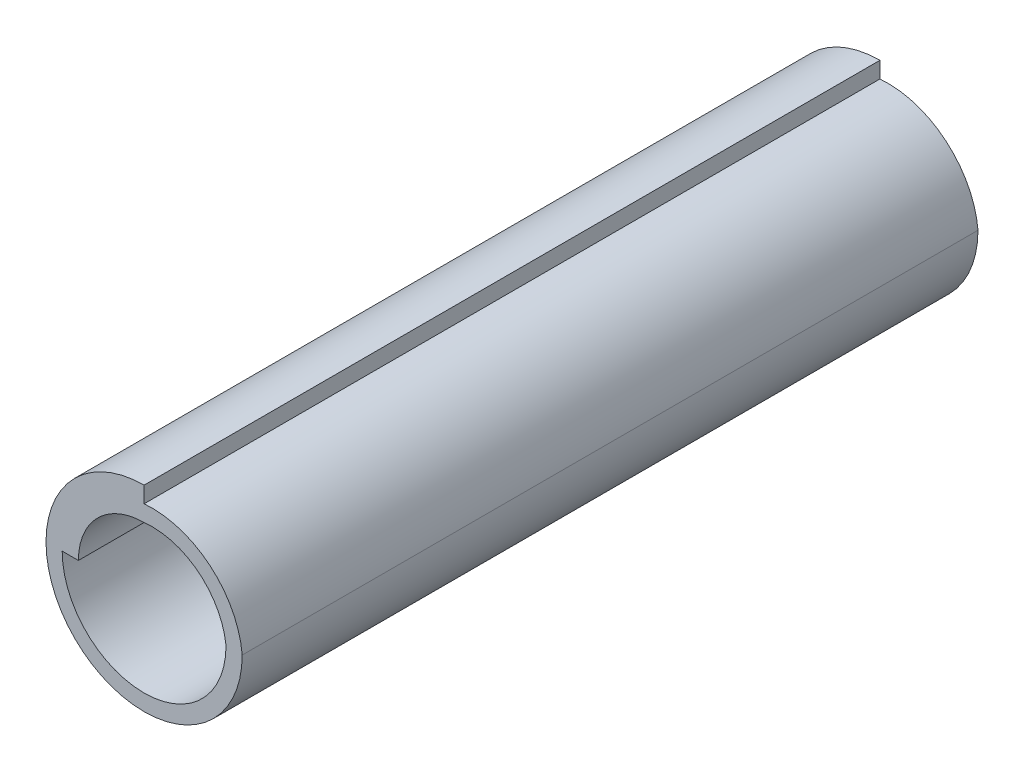
ISO-10303-21;
HEADER;
FILE_DESCRIPTION(('STEP AP214'),'2;1');
FILE_NAME('part.step','',(''),(''),'','','');
FILE_SCHEMA(('AUTOMOTIVE_DESIGN { 1 0 10303 214 1 1 1 1 }'));
ENDSEC;
DATA;
#1=APPLICATION_CONTEXT('core data for automotive mechanical design processes');
#2=APPLICATION_PROTOCOL_DEFINITION('international standard','automotive_design',2000,#1);
#3=PRODUCT_CONTEXT('',#1,'mechanical');
#4=PRODUCT('Part','Part','',(#3));
#5=PRODUCT_RELATED_PRODUCT_CATEGORY('part','',(#4));
#6=PRODUCT_DEFINITION_FORMATION('','',#4);
#7=PRODUCT_DEFINITION_CONTEXT('part definition',#1,'design');
#8=PRODUCT_DEFINITION('design','',#6,#7);
#9=PRODUCT_DEFINITION_SHAPE('','',#8);
#10=(LENGTH_UNIT() NAMED_UNIT(*) SI_UNIT(.MILLI.,.METRE.));
#11=(NAMED_UNIT(*) PLANE_ANGLE_UNIT() SI_UNIT($,.RADIAN.));
#12=(NAMED_UNIT(*) SI_UNIT($,.STERADIAN.) SOLID_ANGLE_UNIT());
#13=UNCERTAINTY_MEASURE_WITH_UNIT(LENGTH_MEASURE(1.E-05),#10,'distance_accuracy_value','');
#14=(GEOMETRIC_REPRESENTATION_CONTEXT(3) GLOBAL_UNCERTAINTY_ASSIGNED_CONTEXT((#13)) GLOBAL_UNIT_ASSIGNED_CONTEXT((#10,
#11,#12)) REPRESENTATION_CONTEXT('',''));
#15=CARTESIAN_POINT('',(0.,0.,0.));
#16=DIRECTION('',(0.,0.,1.));
#17=DIRECTION('',(1.,0.,0.));
#18=AXIS2_PLACEMENT_3D('',#15,#16,#17);
#19=CARTESIAN_POINT('',(0.165000000000001,-0.164999999999998,7.5));
#20=DIRECTION('',(0.,0.,1.));
#21=DIRECTION('',(1.,0.,0.));
#22=AXIS2_PLACEMENT_3D('',#19,#20,#21);
#23=PLANE('',#22);
#24=CARTESIAN_POINT('',(0.165000000000001,-0.164999999999998,7.5));
#25=DIRECTION('',(0.,0.,1.));
#26=DIRECTION('',(1.,0.,0.));
#27=AXIS2_PLACEMENT_3D('',#24,#25,#26);
#28=CIRCLE('',#27,1.84240332175124);
#29=CARTESIAN_POINT('',(2.,0.,7.5));
#30=VERTEX_POINT('',#29);
#31=CARTESIAN_POINT('',(0.,1.67,7.5));
#32=VERTEX_POINT('',#31);
#33=EDGE_CURVE('E134',#30,#32,#28,.T.);
#34=ORIENTED_EDGE('',*,*,#33,.T.);
#35=DIRECTION('',(0.,1.,0.));
#36=VECTOR('',#35,1.);
#37=CARTESIAN_POINT('',(0.,1.67,7.5));
#38=LINE('',#37,#36);
#39=CARTESIAN_POINT('',(0.,2.,7.5));
#40=VERTEX_POINT('',#39);
#41=EDGE_CURVE('E137',#32,#40,#38,.T.);
#42=ORIENTED_EDGE('',*,*,#41,.T.);
#43=CARTESIAN_POINT('',(0.,0.,7.5));
#44=DIRECTION('',(0.,0.,1.));
#45=DIRECTION('',(1.,0.,0.));
#46=AXIS2_PLACEMENT_3D('',#43,#44,#45);
#47=CIRCLE('',#46,2.);
#48=EDGE_CURVE('E140',#40,#30,#47,.T.);
#49=ORIENTED_EDGE('',*,*,#48,.T.);
#50=EDGE_LOOP('',(#34,#42,#49));
#51=FACE_BOUND('',#50,.T.);
#52=CARTESIAN_POINT('',(0.165000000000001,-0.164999999999998,7.5));
#53=DIRECTION('',(0.,0.,1.));
#54=DIRECTION('',(1.,0.,0.));
#55=AXIS2_PLACEMENT_3D('',#52,#53,#54);
#56=CIRCLE('',#55,1.51401783344847);
#57=CARTESIAN_POINT('',(1.67,0.,7.5));
#58=VERTEX_POINT('',#57);
#59=CARTESIAN_POINT('',(0.,1.34,7.5));
#60=VERTEX_POINT('',#59);
#61=EDGE_CURVE('E106',#58,#60,#56,.T.);
#62=ORIENTED_EDGE('',*,*,#61,.F.);
#63=CARTESIAN_POINT('',(0.,0.,7.5));
#64=DIRECTION('',(0.,0.,1.));
#65=DIRECTION('',(1.,0.,0.));
#66=AXIS2_PLACEMENT_3D('',#63,#64,#65);
#67=CIRCLE('',#66,1.67);
#68=CARTESIAN_POINT('',(-1.67,0.,7.5));
#69=VERTEX_POINT('',#68);
#70=EDGE_CURVE('E98',#69,#58,#67,.T.);
#71=ORIENTED_EDGE('',*,*,#70,.F.);
#72=DIRECTION('',(-1.,0.,0.));
#73=VECTOR('',#72,1.);
#74=CARTESIAN_POINT('',(-1.67,0.,7.5));
#75=LINE('',#74,#73);
#76=CARTESIAN_POINT('',(-1.34,0.,7.5));
#77=VERTEX_POINT('',#76);
#78=EDGE_CURVE('E120',#77,#69,#75,.T.);
#79=ORIENTED_EDGE('',*,*,#78,.F.);
#80=CARTESIAN_POINT('',(0.,0.,7.5));
#81=DIRECTION('',(0.,0.,1.));
#82=DIRECTION('',(1.,0.,0.));
#83=AXIS2_PLACEMENT_3D('',#80,#81,#82);
#84=CIRCLE('',#83,1.34);
#85=EDGE_CURVE('E118',#60,#77,#84,.T.);
#86=ORIENTED_EDGE('',*,*,#85,.F.);
#87=EDGE_LOOP('',(#62,#71,#79,#86));
#88=FACE_BOUND('',#87,.T.);
#89=ADVANCED_FACE('F39',(#51,#88),#23,.T.);
#90=CARTESIAN_POINT('',(0.165000000000001,-0.164999999999998,-7.5));
#91=DIRECTION('',(0.,0.,1.));
#92=DIRECTION('',(1.,0.,0.));
#93=AXIS2_PLACEMENT_3D('',#90,#91,#92);
#94=PLANE('',#93);
#95=CARTESIAN_POINT('',(0.165000000000001,-0.164999999999998,-7.5));
#96=DIRECTION('',(0.,0.,1.));
#97=DIRECTION('',(1.,0.,0.));
#98=AXIS2_PLACEMENT_3D('',#95,#96,#97);
#99=CIRCLE('',#98,1.84240332175124);
#100=CARTESIAN_POINT('',(2.,0.,-7.5));
#101=VERTEX_POINT('',#100);
#102=CARTESIAN_POINT('',(0.,1.67,-7.5));
#103=VERTEX_POINT('',#102);
#104=EDGE_CURVE('E114',#101,#103,#99,.T.);
#105=ORIENTED_EDGE('',*,*,#104,.F.);
#106=CARTESIAN_POINT('',(0.,0.,-7.5));
#107=DIRECTION('',(0.,0.,1.));
#108=DIRECTION('',(1.,0.,0.));
#109=AXIS2_PLACEMENT_3D('',#106,#107,#108);
#110=CIRCLE('',#109,2.);
#111=CARTESIAN_POINT('',(0.,2.,-7.5));
#112=VERTEX_POINT('',#111);
#113=EDGE_CURVE('E138',#112,#101,#110,.T.);
#114=ORIENTED_EDGE('',*,*,#113,.F.);
#115=DIRECTION('',(0.,1.,0.));
#116=VECTOR('',#115,1.);
#117=CARTESIAN_POINT('',(0.,1.67,-7.5));
#118=LINE('',#117,#116);
#119=EDGE_CURVE('E145',#103,#112,#118,.T.);
#120=ORIENTED_EDGE('',*,*,#119,.F.);
#121=EDGE_LOOP('',(#105,#114,#120));
#122=FACE_BOUND('',#121,.T.);
#123=CARTESIAN_POINT('',(0.,0.,-7.5));
#124=DIRECTION('',(0.,0.,1.));
#125=DIRECTION('',(1.,0.,0.));
#126=AXIS2_PLACEMENT_3D('',#123,#124,#125);
#127=CIRCLE('',#126,1.67);
#128=CARTESIAN_POINT('',(-1.67,0.,-7.5));
#129=VERTEX_POINT('',#128);
#130=CARTESIAN_POINT('',(1.67,0.,-7.5));
#131=VERTEX_POINT('',#130);
#132=EDGE_CURVE('E62',#129,#131,#127,.T.);
#133=ORIENTED_EDGE('',*,*,#132,.T.);
#134=CARTESIAN_POINT('',(0.165000000000001,-0.164999999999998,-7.5));
#135=DIRECTION('',(0.,0.,1.));
#136=DIRECTION('',(1.,0.,0.));
#137=AXIS2_PLACEMENT_3D('',#134,#135,#136);
#138=CIRCLE('',#137,1.51401783344847);
#139=CARTESIAN_POINT('',(0.,1.34,-7.5));
#140=VERTEX_POINT('',#139);
#141=EDGE_CURVE('E113',#131,#140,#138,.T.);
#142=ORIENTED_EDGE('',*,*,#141,.T.);
#143=CARTESIAN_POINT('',(0.,0.,-7.5));
#144=DIRECTION('',(0.,0.,1.));
#145=DIRECTION('',(1.,0.,0.));
#146=AXIS2_PLACEMENT_3D('',#143,#144,#145);
#147=CIRCLE('',#146,1.34);
#148=CARTESIAN_POINT('',(-1.34,0.,-7.5));
#149=VERTEX_POINT('',#148);
#150=EDGE_CURVE('E126',#140,#149,#147,.T.);
#151=ORIENTED_EDGE('',*,*,#150,.T.);
#152=DIRECTION('',(-1.,0.,0.));
#153=VECTOR('',#152,1.);
#154=CARTESIAN_POINT('',(-1.67,0.,-7.5));
#155=LINE('',#154,#153);
#156=EDGE_CURVE('E107',#149,#129,#155,.T.);
#157=ORIENTED_EDGE('',*,*,#156,.T.);
#158=EDGE_LOOP('',(#133,#142,#151,#157));
#159=FACE_BOUND('',#158,.T.);
#160=ADVANCED_FACE('F159',(#122,#159),#94,.F.);
#161=CARTESIAN_POINT('',(0.165000000000001,-0.164999999999998,7.5));
#162=DIRECTION('',(0.,0.,-1.));
#163=DIRECTION('',(-1.,0.,0.));
#164=AXIS2_PLACEMENT_3D('',#161,#162,#163);
#165=CYLINDRICAL_SURFACE('',#164,1.84240332175124);
#166=ORIENTED_EDGE('',*,*,#104,.T.);
#167=DIRECTION('',(0.,0.,-1.));
#168=VECTOR('',#167,1.);
#169=CARTESIAN_POINT('',(0.,1.67,7.5));
#170=LINE('',#169,#168);
#171=EDGE_CURVE('E11',#32,#103,#170,.T.);
#172=ORIENTED_EDGE('',*,*,#171,.F.);
#173=ORIENTED_EDGE('',*,*,#33,.F.);
#174=DIRECTION('',(0.,0.,-1.));
#175=VECTOR('',#174,1.);
#176=CARTESIAN_POINT('',(2.,0.,7.5));
#177=LINE('',#176,#175);
#178=EDGE_CURVE('E142',#30,#101,#177,.T.);
#179=ORIENTED_EDGE('',*,*,#178,.T.);
#180=EDGE_LOOP('',(#166,#172,#173,#179));
#181=FACE_BOUND('',#180,.T.);
#182=ADVANCED_FACE('F41',(#181),#165,.T.);
#183=CARTESIAN_POINT('',(0.,1.67,7.5));
#184=DIRECTION('',(-1.,0.,0.));
#185=DIRECTION('',(0.,0.,1.));
#186=AXIS2_PLACEMENT_3D('',#183,#184,#185);
#187=PLANE('',#186);
#188=ORIENTED_EDGE('',*,*,#119,.T.);
#189=DIRECTION('',(0.,0.,-1.));
#190=VECTOR('',#189,1.);
#191=CARTESIAN_POINT('',(0.,2.,7.5));
#192=LINE('',#191,#190);
#193=EDGE_CURVE('E47',#40,#112,#192,.T.);
#194=ORIENTED_EDGE('',*,*,#193,.F.);
#195=ORIENTED_EDGE('',*,*,#41,.F.);
#196=ORIENTED_EDGE('',*,*,#171,.T.);
#197=EDGE_LOOP('',(#188,#194,#195,#196));
#198=FACE_BOUND('',#197,.T.);
#199=ADVANCED_FACE('F165',(#198),#187,.F.);
#200=CARTESIAN_POINT('',(0.,0.,7.5));
#201=DIRECTION('',(0.,0.,-1.));
#202=DIRECTION('',(-1.,0.,0.));
#203=AXIS2_PLACEMENT_3D('',#200,#201,#202);
#204=CYLINDRICAL_SURFACE('',#203,2.);
#205=ORIENTED_EDGE('',*,*,#113,.T.);
#206=ORIENTED_EDGE('',*,*,#178,.F.);
#207=ORIENTED_EDGE('',*,*,#48,.F.);
#208=ORIENTED_EDGE('',*,*,#193,.T.);
#209=EDGE_LOOP('',(#205,#206,#207,#208));
#210=FACE_BOUND('',#209,.T.);
#211=ADVANCED_FACE('F154',(#210),#204,.T.);
#212=CARTESIAN_POINT('',(0.,0.,7.5));
#213=DIRECTION('',(0.,0.,-1.));
#214=DIRECTION('',(-1.,0.,0.));
#215=AXIS2_PLACEMENT_3D('',#212,#213,#214);
#216=CYLINDRICAL_SURFACE('',#215,1.67);
#217=ORIENTED_EDGE('',*,*,#132,.F.);
#218=DIRECTION('',(0.,0.,-1.));
#219=VECTOR('',#218,1.);
#220=CARTESIAN_POINT('',(-1.67,0.,7.5));
#221=LINE('',#220,#219);
#222=EDGE_CURVE('E102',#69,#129,#221,.T.);
#223=ORIENTED_EDGE('',*,*,#222,.F.);
#224=ORIENTED_EDGE('',*,*,#70,.T.);
#225=DIRECTION('',(0.,0.,-1.));
#226=VECTOR('',#225,1.);
#227=CARTESIAN_POINT('',(1.67,0.,7.5));
#228=LINE('',#227,#226);
#229=EDGE_CURVE('E101',#58,#131,#228,.T.);
#230=ORIENTED_EDGE('',*,*,#229,.T.);
#231=EDGE_LOOP('',(#217,#223,#224,#230));
#232=FACE_BOUND('',#231,.T.);
#233=ADVANCED_FACE('F100',(#232),#216,.F.);
#234=CARTESIAN_POINT('',(0.165000000000001,-0.164999999999998,7.5));
#235=DIRECTION('',(0.,0.,-1.));
#236=DIRECTION('',(-1.,0.,0.));
#237=AXIS2_PLACEMENT_3D('',#234,#235,#236);
#238=CYLINDRICAL_SURFACE('',#237,1.51401783344847);
#239=ORIENTED_EDGE('',*,*,#141,.F.);
#240=ORIENTED_EDGE('',*,*,#229,.F.);
#241=ORIENTED_EDGE('',*,*,#61,.T.);
#242=DIRECTION('',(0.,0.,-1.));
#243=VECTOR('',#242,1.);
#244=CARTESIAN_POINT('',(0.,1.34,7.5));
#245=LINE('',#244,#243);
#246=EDGE_CURVE('E115',#60,#140,#245,.T.);
#247=ORIENTED_EDGE('',*,*,#246,.T.);
#248=EDGE_LOOP('',(#239,#240,#241,#247));
#249=FACE_BOUND('',#248,.T.);
#250=ADVANCED_FACE('F110',(#249),#238,.F.);
#251=CARTESIAN_POINT('',(0.,0.,7.5));
#252=DIRECTION('',(0.,0.,-1.));
#253=DIRECTION('',(-1.,0.,0.));
#254=AXIS2_PLACEMENT_3D('',#251,#252,#253);
#255=CYLINDRICAL_SURFACE('',#254,1.34);
#256=ORIENTED_EDGE('',*,*,#150,.F.);
#257=ORIENTED_EDGE('',*,*,#246,.F.);
#258=ORIENTED_EDGE('',*,*,#85,.T.);
#259=DIRECTION('',(0.,0.,-1.));
#260=VECTOR('',#259,1.);
#261=CARTESIAN_POINT('',(-1.34,0.,7.5));
#262=LINE('',#261,#260);
#263=EDGE_CURVE('E54',#77,#149,#262,.T.);
#264=ORIENTED_EDGE('',*,*,#263,.T.);
#265=EDGE_LOOP('',(#256,#257,#258,#264));
#266=FACE_BOUND('',#265,.T.);
#267=ADVANCED_FACE('F183',(#266),#255,.F.);
#268=CARTESIAN_POINT('',(-1.67,0.,7.5));
#269=DIRECTION('',(0.,-1.,0.));
#270=DIRECTION('',(0.,0.,-1.));
#271=AXIS2_PLACEMENT_3D('',#268,#269,#270);
#272=PLANE('',#271);
#273=ORIENTED_EDGE('',*,*,#156,.F.);
#274=ORIENTED_EDGE('',*,*,#263,.F.);
#275=ORIENTED_EDGE('',*,*,#78,.T.);
#276=ORIENTED_EDGE('',*,*,#222,.T.);
#277=EDGE_LOOP('',(#273,#274,#275,#276));
#278=FACE_BOUND('',#277,.T.);
#279=ADVANCED_FACE('F186',(#278),#272,.T.);
#280=CLOSED_SHELL('',(#89,#160,#182,#199,#211,#233,#250,#267,#279));
#281=MANIFOLD_SOLID_BREP('B2',#280);
#282=ADVANCED_BREP_SHAPE_REPRESENTATION('',(#18,#281),#14);
#283=SHAPE_DEFINITION_REPRESENTATION(#9,#282);
ENDSEC;
END-ISO-10303-21;
